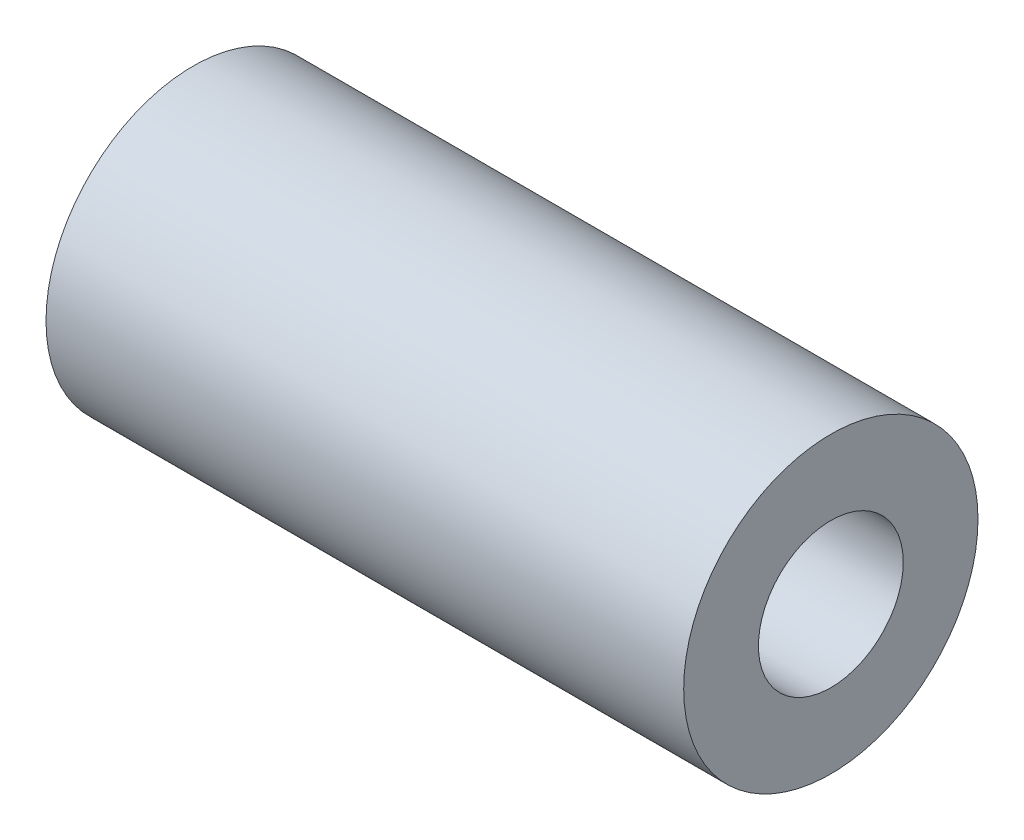
ISO-10303-21;
HEADER;
FILE_DESCRIPTION(('STEP AP214'),'2;1');
FILE_NAME('part.step','',(''),(''),'','','');
FILE_SCHEMA(('AUTOMOTIVE_DESIGN { 1 0 10303 214 1 1 1 1 }'));
ENDSEC;
DATA;
#1=APPLICATION_CONTEXT('core data for automotive mechanical design processes');
#2=APPLICATION_PROTOCOL_DEFINITION('international standard','automotive_design',2000,#1);
#3=PRODUCT_CONTEXT('',#1,'mechanical');
#4=PRODUCT('Part','Part','',(#3));
#5=PRODUCT_RELATED_PRODUCT_CATEGORY('part','',(#4));
#6=PRODUCT_DEFINITION_FORMATION('','',#4);
#7=PRODUCT_DEFINITION_CONTEXT('part definition',#1,'design');
#8=PRODUCT_DEFINITION('design','',#6,#7);
#9=PRODUCT_DEFINITION_SHAPE('','',#8);
#10=(LENGTH_UNIT() NAMED_UNIT(*) SI_UNIT(.MILLI.,.METRE.));
#11=(NAMED_UNIT(*) PLANE_ANGLE_UNIT() SI_UNIT($,.RADIAN.));
#12=(NAMED_UNIT(*) SI_UNIT($,.STERADIAN.) SOLID_ANGLE_UNIT());
#13=UNCERTAINTY_MEASURE_WITH_UNIT(LENGTH_MEASURE(1.E-05),#10,'distance_accuracy_value','');
#14=(GEOMETRIC_REPRESENTATION_CONTEXT(3) GLOBAL_UNCERTAINTY_ASSIGNED_CONTEXT((#13)) GLOBAL_UNIT_ASSIGNED_CONTEXT((#10,
#11,#12)) REPRESENTATION_CONTEXT('',''));
#15=CARTESIAN_POINT('',(0.,0.,0.));
#16=DIRECTION('',(0.,0.,1.));
#17=DIRECTION('',(1.,0.,0.));
#18=AXIS2_PLACEMENT_3D('',#15,#16,#17);
#19=CARTESIAN_POINT('',(16.51,0.,0.));
#20=DIRECTION('',(1.,0.,0.));
#21=DIRECTION('',(0.,0.,-1.));
#22=AXIS2_PLACEMENT_3D('',#19,#20,#21);
#23=PLANE('',#22);
#24=CARTESIAN_POINT('',(16.51,0.,0.));
#25=DIRECTION('',(1.,0.,0.));
#26=DIRECTION('',(0.,0.,-1.));
#27=AXIS2_PLACEMENT_3D('',#24,#25,#26);
#28=CIRCLE('',#27,3.81);
#29=CARTESIAN_POINT('',(16.51,0.,-3.81));
#30=VERTEX_POINT('',#29);
#31=EDGE_CURVE('E10',#30,#30,#28,.T.);
#32=ORIENTED_EDGE('',*,*,#31,.T.);
#33=EDGE_LOOP('',(#32));
#34=FACE_BOUND('',#33,.T.);
#35=CARTESIAN_POINT('',(16.51,0.,0.));
#36=DIRECTION('',(1.,0.,0.));
#37=DIRECTION('',(0.,0.,-1.));
#38=AXIS2_PLACEMENT_3D('',#35,#36,#37);
#39=CIRCLE('',#38,1.875);
#40=CARTESIAN_POINT('',(16.51,0.,-1.875));
#41=VERTEX_POINT('',#40);
#42=EDGE_CURVE('E44',#41,#41,#39,.T.);
#43=ORIENTED_EDGE('',*,*,#42,.F.);
#44=EDGE_LOOP('',(#43));
#45=FACE_BOUND('',#44,.T.);
#46=ADVANCED_FACE('F33',(#34,#45),#23,.T.);
#47=CARTESIAN_POINT('',(0.,0.,0.));
#48=DIRECTION('',(1.,0.,0.));
#49=DIRECTION('',(0.,0.,-1.));
#50=AXIS2_PLACEMENT_3D('',#47,#48,#49);
#51=PLANE('',#50);
#52=CARTESIAN_POINT('',(0.,0.,0.));
#53=DIRECTION('',(1.,0.,0.));
#54=DIRECTION('',(0.,0.,-1.));
#55=AXIS2_PLACEMENT_3D('',#52,#53,#54);
#56=CIRCLE('',#55,3.81);
#57=CARTESIAN_POINT('',(0.,0.,-3.81));
#58=VERTEX_POINT('',#57);
#59=EDGE_CURVE('E37',#58,#58,#56,.T.);
#60=ORIENTED_EDGE('',*,*,#59,.F.);
#61=EDGE_LOOP('',(#60));
#62=FACE_BOUND('',#61,.T.);
#63=CARTESIAN_POINT('',(0.,0.,0.));
#64=DIRECTION('',(1.,0.,0.));
#65=DIRECTION('',(0.,0.,-1.));
#66=AXIS2_PLACEMENT_3D('',#63,#64,#65);
#67=CIRCLE('',#66,1.875);
#68=CARTESIAN_POINT('',(0.,0.,-1.875));
#69=VERTEX_POINT('',#68);
#70=EDGE_CURVE('E46',#69,#69,#67,.T.);
#71=ORIENTED_EDGE('',*,*,#70,.T.);
#72=EDGE_LOOP('',(#71));
#73=FACE_BOUND('',#72,.T.);
#74=ADVANCED_FACE('F56',(#62,#73),#51,.F.);
#75=CARTESIAN_POINT('',(16.51,0.,0.));
#76=DIRECTION('',(-1.,0.,0.));
#77=DIRECTION('',(0.,0.,1.));
#78=AXIS2_PLACEMENT_3D('',#75,#76,#77);
#79=CYLINDRICAL_SURFACE('',#78,3.81);
#80=ORIENTED_EDGE('',*,*,#31,.F.);
#81=EDGE_LOOP('',(#80));
#82=FACE_BOUND('',#81,.T.);
#83=ORIENTED_EDGE('',*,*,#59,.T.);
#84=EDGE_LOOP('',(#83));
#85=FACE_BOUND('',#84,.T.);
#86=ADVANCED_FACE('F35',(#82,#85),#79,.T.);
#87=CARTESIAN_POINT('',(16.51,0.,0.));
#88=DIRECTION('',(-1.,0.,0.));
#89=DIRECTION('',(0.,0.,1.));
#90=AXIS2_PLACEMENT_3D('',#87,#88,#89);
#91=CYLINDRICAL_SURFACE('',#90,1.875);
#92=ORIENTED_EDGE('',*,*,#42,.T.);
#93=EDGE_LOOP('',(#92));
#94=FACE_BOUND('',#93,.T.);
#95=ORIENTED_EDGE('',*,*,#70,.F.);
#96=EDGE_LOOP('',(#95));
#97=FACE_BOUND('',#96,.T.);
#98=ADVANCED_FACE('F52',(#94,#97),#91,.F.);
#99=CLOSED_SHELL('',(#46,#74,#86,#98));
#100=MANIFOLD_SOLID_BREP('B2',#99);
#101=ADVANCED_BREP_SHAPE_REPRESENTATION('',(#18,#100),#14);
#102=SHAPE_DEFINITION_REPRESENTATION(#9,#101);
ENDSEC;
END-ISO-10303-21;
